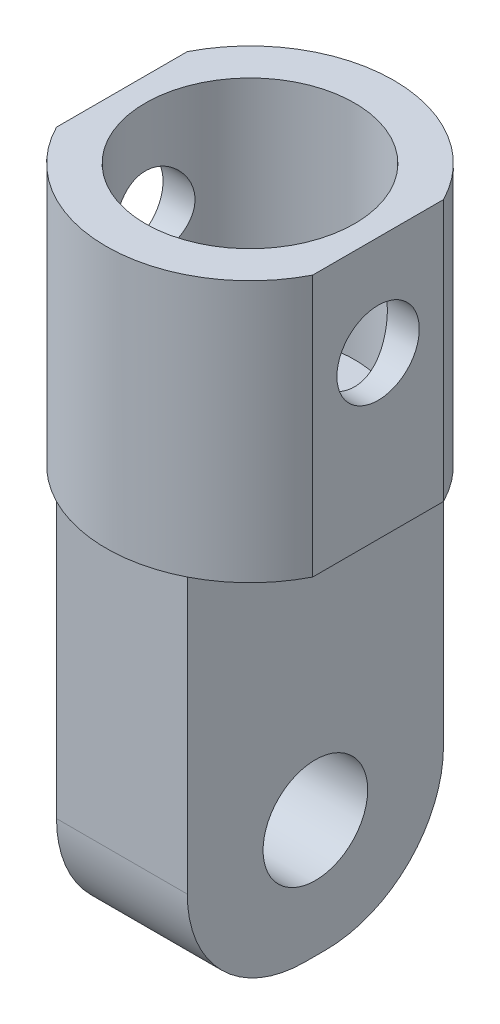
ISO-10303-21;
HEADER;
FILE_DESCRIPTION(('STEP AP214'),'2;1');
FILE_NAME('part.step','',(''),(''),'','','');
FILE_SCHEMA(('AUTOMOTIVE_DESIGN { 1 0 10303 214 1 1 1 1 }'));
ENDSEC;
DATA;
#1=APPLICATION_CONTEXT('core data for automotive mechanical design processes');
#2=APPLICATION_PROTOCOL_DEFINITION('international standard','automotive_design',2000,#1);
#3=PRODUCT_CONTEXT('',#1,'mechanical');
#4=PRODUCT('Part','Part','',(#3));
#5=PRODUCT_RELATED_PRODUCT_CATEGORY('part','',(#4));
#6=PRODUCT_DEFINITION_FORMATION('','',#4);
#7=PRODUCT_DEFINITION_CONTEXT('part definition',#1,'design');
#8=PRODUCT_DEFINITION('design','',#6,#7);
#9=PRODUCT_DEFINITION_SHAPE('','',#8);
#10=(LENGTH_UNIT() NAMED_UNIT(*) SI_UNIT(.MILLI.,.METRE.));
#11=(NAMED_UNIT(*) PLANE_ANGLE_UNIT() SI_UNIT($,.RADIAN.));
#12=(NAMED_UNIT(*) SI_UNIT($,.STERADIAN.) SOLID_ANGLE_UNIT());
#13=UNCERTAINTY_MEASURE_WITH_UNIT(LENGTH_MEASURE(1.E-05),#10,'distance_accuracy_value','');
#14=(GEOMETRIC_REPRESENTATION_CONTEXT(3) GLOBAL_UNCERTAINTY_ASSIGNED_CONTEXT((#13)) GLOBAL_UNIT_ASSIGNED_CONTEXT((#10,
#11,#12)) REPRESENTATION_CONTEXT('',''));
#15=CARTESIAN_POINT('',(0.,0.,0.));
#16=DIRECTION('',(0.,0.,1.));
#17=DIRECTION('',(1.,0.,0.));
#18=AXIS2_PLACEMENT_3D('',#15,#16,#17);
#19=CARTESIAN_POINT('',(0.,20.,0.));
#20=DIRECTION('',(0.,-1.,0.));
#21=DIRECTION('',(0.,0.,-1.));
#22=AXIS2_PLACEMENT_3D('',#19,#20,#21);
#23=CYLINDRICAL_SURFACE('',#22,11.);
#24=CARTESIAN_POINT('',(0.,20.,0.));
#25=DIRECTION('',(0.,1.,0.));
#26=DIRECTION('',(0.,0.,1.));
#27=AXIS2_PLACEMENT_3D('',#24,#25,#26);
#28=CIRCLE('',#27,11.);
#29=CARTESIAN_POINT('',(9.79795897113271,20.,-5.));
#30=VERTEX_POINT('',#29);
#31=CARTESIAN_POINT('',(-9.79795897113271,20.,-5.));
#32=VERTEX_POINT('',#31);
#33=EDGE_CURVE('E132',#30,#32,#28,.T.);
#34=ORIENTED_EDGE('',*,*,#33,.F.);
#35=DIRECTION('',(0.,1.,0.));
#36=VECTOR('',#35,1.);
#37=CARTESIAN_POINT('',(9.79795897113271,-30.,-5.));
#38=LINE('',#37,#36);
#39=CARTESIAN_POINT('',(9.79795897113271,0.,-5.));
#40=VERTEX_POINT('',#39);
#41=EDGE_CURVE('E49',#40,#30,#38,.T.);
#42=ORIENTED_EDGE('',*,*,#41,.F.);
#43=CARTESIAN_POINT('',(0.,0.,0.));
#44=DIRECTION('',(0.,1.,0.));
#45=DIRECTION('',(0.,0.,1.));
#46=AXIS2_PLACEMENT_3D('',#43,#44,#45);
#47=CIRCLE('',#46,11.);
#48=CARTESIAN_POINT('',(5.,0.,-9.79795897113272));
#49=VERTEX_POINT('',#48);
#50=EDGE_CURVE('E142',#40,#49,#47,.T.);
#51=ORIENTED_EDGE('',*,*,#50,.T.);
#52=CARTESIAN_POINT('',(-5.,0.,-9.79795897113271));
#53=VERTEX_POINT('',#52);
#54=EDGE_CURVE('E143',#49,#53,#47,.T.);
#55=ORIENTED_EDGE('',*,*,#54,.T.);
#56=CARTESIAN_POINT('',(-9.79795897113271,0.,-5.));
#57=VERTEX_POINT('',#56);
#58=EDGE_CURVE('E203',#53,#57,#47,.T.);
#59=ORIENTED_EDGE('',*,*,#58,.T.);
#60=DIRECTION('',(0.,1.,0.));
#61=VECTOR('',#60,1.);
#62=CARTESIAN_POINT('',(-9.79795897113271,-30.,-5.));
#63=LINE('',#62,#61);
#64=EDGE_CURVE('E447',#57,#32,#63,.T.);
#65=ORIENTED_EDGE('',*,*,#64,.T.);
#66=EDGE_LOOP('',(#34,#42,#51,#55,#59,#65));
#67=FACE_BOUND('',#66,.T.);
#68=ADVANCED_FACE('F34',(#67),#23,.T.);
#69=CARTESIAN_POINT('',(0.,0.,0.));
#70=DIRECTION('',(0.,1.,0.));
#71=DIRECTION('',(0.,0.,1.));
#72=AXIS2_PLACEMENT_3D('',#69,#70,#71);
#73=PLANE('',#72);
#74=ORIENTED_EDGE('',*,*,#50,.F.);
#75=DIRECTION('',(0.,0.,1.));
#76=VECTOR('',#75,1.);
#77=CARTESIAN_POINT('',(9.79795897113271,0.,0.));
#78=LINE('',#77,#76);
#79=CARTESIAN_POINT('',(9.79795897113271,0.,5.));
#80=VERTEX_POINT('',#79);
#81=EDGE_CURVE('E126',#40,#80,#78,.T.);
#82=ORIENTED_EDGE('',*,*,#81,.T.);
#83=CARTESIAN_POINT('',(5.,0.,9.79795897113272));
#84=VERTEX_POINT('',#83);
#85=EDGE_CURVE('E125',#84,#80,#47,.T.);
#86=ORIENTED_EDGE('',*,*,#85,.F.);
#87=DIRECTION('',(0.,0.,1.));
#88=VECTOR('',#87,1.);
#89=CARTESIAN_POINT('',(5.,0.,9.79795897113272));
#90=LINE('',#89,#88);
#91=EDGE_CURVE('E146',#49,#84,#90,.T.);
#92=ORIENTED_EDGE('',*,*,#91,.F.);
#93=EDGE_LOOP('',(#74,#82,#86,#92));
#94=FACE_BOUND('',#93,.T.);
#95=ADVANCED_FACE('F221',(#94),#73,.F.);
#96=DIRECTION('',(1.,0.,0.));
#97=VECTOR('',#96,1.);
#98=CARTESIAN_POINT('',(-5.,0.,-9.79795897113272));
#99=LINE('',#98,#97);
#100=EDGE_CURVE('E176',#53,#49,#99,.T.);
#101=ORIENTED_EDGE('',*,*,#100,.F.);
#102=ORIENTED_EDGE('',*,*,#54,.F.);
#103=EDGE_LOOP('',(#101,#102));
#104=FACE_BOUND('',#103,.T.);
#105=ADVANCED_FACE('F226',(#104),#73,.F.);
#106=CARTESIAN_POINT('',(-9.79795897113271,0.,5.));
#107=VERTEX_POINT('',#106);
#108=CARTESIAN_POINT('',(-5.,0.,9.79795897113272));
#109=VERTEX_POINT('',#108);
#110=EDGE_CURVE('E202',#107,#109,#47,.T.);
#111=ORIENTED_EDGE('',*,*,#110,.F.);
#112=DIRECTION('',(0.,0.,-1.));
#113=VECTOR('',#112,1.);
#114=CARTESIAN_POINT('',(-9.79795897113271,0.,0.));
#115=LINE('',#114,#113);
#116=EDGE_CURVE('E431',#107,#57,#115,.T.);
#117=ORIENTED_EDGE('',*,*,#116,.T.);
#118=ORIENTED_EDGE('',*,*,#58,.F.);
#119=DIRECTION('',(0.,0.,-1.));
#120=VECTOR('',#119,1.);
#121=CARTESIAN_POINT('',(-5.,0.,9.79795897113272));
#122=LINE('',#121,#120);
#123=EDGE_CURVE('E425',#109,#53,#122,.T.);
#124=ORIENTED_EDGE('',*,*,#123,.F.);
#125=EDGE_LOOP('',(#111,#117,#118,#124));
#126=FACE_BOUND('',#125,.T.);
#127=ADVANCED_FACE('F338',(#126),#73,.F.);
#128=DIRECTION('',(-1.,0.,0.));
#129=VECTOR('',#128,1.);
#130=CARTESIAN_POINT('',(-5.,0.,9.79795897113272));
#131=LINE('',#130,#129);
#132=EDGE_CURVE('E190',#84,#109,#131,.T.);
#133=ORIENTED_EDGE('',*,*,#132,.F.);
#134=EDGE_CURVE('E199',#109,#84,#47,.T.);
#135=ORIENTED_EDGE('',*,*,#134,.F.);
#136=EDGE_LOOP('',(#133,#135));
#137=FACE_BOUND('',#136,.T.);
#138=ADVANCED_FACE('F217',(#137),#73,.F.);
#139=ORIENTED_EDGE('',*,*,#85,.T.);
#140=DIRECTION('',(0.,1.,0.));
#141=VECTOR('',#140,1.);
#142=CARTESIAN_POINT('',(9.79795897113271,-30.,5.));
#143=LINE('',#142,#141);
#144=CARTESIAN_POINT('',(9.79795897113271,20.,5.));
#145=VERTEX_POINT('',#144);
#146=EDGE_CURVE('E111',#80,#145,#143,.T.);
#147=ORIENTED_EDGE('',*,*,#146,.T.);
#148=CARTESIAN_POINT('',(-9.79795897113271,20.,5.));
#149=VERTEX_POINT('',#148);
#150=EDGE_CURVE('E122',#149,#145,#28,.T.);
#151=ORIENTED_EDGE('',*,*,#150,.F.);
#152=DIRECTION('',(0.,1.,0.));
#153=VECTOR('',#152,1.);
#154=CARTESIAN_POINT('',(-9.79795897113271,-30.,5.));
#155=LINE('',#154,#153);
#156=EDGE_CURVE('E57',#107,#149,#155,.T.);
#157=ORIENTED_EDGE('',*,*,#156,.F.);
#158=ORIENTED_EDGE('',*,*,#110,.T.);
#159=ORIENTED_EDGE('',*,*,#134,.T.);
#160=EDGE_LOOP('',(#139,#147,#151,#157,#158,#159));
#161=FACE_BOUND('',#160,.T.);
#162=ADVANCED_FACE('F121',(#161),#23,.T.);
#163=CARTESIAN_POINT('',(0.,20.,0.));
#164=DIRECTION('',(0.,1.,0.));
#165=DIRECTION('',(0.,0.,1.));
#166=AXIS2_PLACEMENT_3D('',#163,#164,#165);
#167=PLANE('',#166);
#168=DIRECTION('',(0.,0.,1.));
#169=VECTOR('',#168,1.);
#170=CARTESIAN_POINT('',(9.79795897113271,20.,5.));
#171=LINE('',#170,#169);
#172=EDGE_CURVE('E108',#30,#145,#171,.T.);
#173=ORIENTED_EDGE('',*,*,#172,.F.);
#174=ORIENTED_EDGE('',*,*,#33,.T.);
#175=DIRECTION('',(0.,0.,-1.));
#176=VECTOR('',#175,1.);
#177=CARTESIAN_POINT('',(-9.79795897113271,20.,-5.));
#178=LINE('',#177,#176);
#179=EDGE_CURVE('E130',#149,#32,#178,.T.);
#180=ORIENTED_EDGE('',*,*,#179,.F.);
#181=ORIENTED_EDGE('',*,*,#150,.T.);
#182=EDGE_LOOP('',(#173,#174,#180,#181));
#183=FACE_BOUND('',#182,.T.);
#184=CARTESIAN_POINT('',(0.,20.,0.));
#185=DIRECTION('',(0.,1.,0.));
#186=DIRECTION('',(0.,0.,1.));
#187=AXIS2_PLACEMENT_3D('',#184,#185,#186);
#188=CIRCLE('',#187,8.);
#189=CARTESIAN_POINT('',(0.,20.,8.));
#190=VERTEX_POINT('',#189);
#191=EDGE_CURVE('E139',#190,#190,#188,.T.);
#192=ORIENTED_EDGE('',*,*,#191,.F.);
#193=EDGE_LOOP('',(#192));
#194=FACE_BOUND('',#193,.T.);
#195=ADVANCED_FACE('F128',(#183,#194),#167,.T.);
#196=CARTESIAN_POINT('',(0.,3.,0.));
#197=DIRECTION('',(0.,1.,0.));
#198=DIRECTION('',(0.,0.,1.));
#199=AXIS2_PLACEMENT_3D('',#196,#197,#198);
#200=CYLINDRICAL_SURFACE('',#199,8.);
#201=CARTESIAN_POINT('',(7.35374054478399,12.35,3.15));
#202=CARTESIAN_POINT('',(7.35374704275754,12.1810348254645,3.14999329602681));
#203=CARTESIAN_POINT('',(7.35964488132014,12.0117807408823,3.136323798316));
#204=CARTESIAN_POINT('',(7.38248098553594,11.6781322197495,3.08217479301927));
#205=CARTESIAN_POINT('',(7.39944798830626,11.5137515999202,3.04162549725112));
#206=CARTESIAN_POINT('',(7.44219035883316,11.1952112308682,2.93547843708839));
#207=CARTESIAN_POINT('',(7.46793314944103,11.0410161629554,2.86997320893021));
#208=CARTESIAN_POINT('',(7.52527807571537,10.7458441574431,2.71604659017176));
#209=CARTESIAN_POINT('',(7.5568787965306,10.604864040423,2.62763073107179));
#210=CARTESIAN_POINT('',(7.6243406753394,10.3322290586944,2.42515070634289));
#211=CARTESIAN_POINT('',(7.66033608931628,10.2013979668871,2.31002154319964));
#212=CARTESIAN_POINT('',(7.7314206563645,9.96030105864672,2.05962652874696));
#213=CARTESIAN_POINT('',(7.76650949423601,9.85004231410292,1.92435378156596));
#214=CARTESIAN_POINT('',(7.83343105566126,9.64917322972754,1.63118886560851));
#215=CARTESIAN_POINT('',(7.86508928300074,9.5594691952287,1.47263229358019));
#216=CARTESIAN_POINT('',(7.91996137827719,9.40835631734754,1.14121079140085));
#217=CARTESIAN_POINT('',(7.94317858100774,9.34693629724391,0.968351545009344));
#218=CARTESIAN_POINT('',(7.97760300100542,9.25705763120076,0.62186368052048));
#219=CARTESIAN_POINT('',(7.98932412078716,9.22718348561409,0.448654316915275));
#220=CARTESIAN_POINT('',(8.00128981699939,9.19669238432047,0.0993109398634188));
#221=CARTESIAN_POINT('',(8.00153853623343,9.19606486734988,-0.0768219948664005));
#222=CARTESIAN_POINT('',(7.99084778436078,9.22329638075693,-0.416802700095247));
#223=CARTESIAN_POINT('',(7.98051685822801,9.2496059616175,-0.580797145639845));
#224=CARTESIAN_POINT('',(7.95064223197148,9.32733679922551,-0.901825546505655));
#225=CARTESIAN_POINT('',(7.93109785766046,9.37875989364565,-1.05885899154069));
#226=CARTESIAN_POINT('',(7.8843454024343,9.50589437907237,-1.36431257562693));
#227=CARTESIAN_POINT('',(7.85702699397564,9.58195778332258,-1.51256861644556));
#228=CARTESIAN_POINT('',(7.79745124224497,9.75588883950001,-1.79459197448035));
#229=CARTESIAN_POINT('',(7.76519223059879,9.85376386201245,-1.92835437123989));
#230=CARTESIAN_POINT('',(7.69659093911767,10.0758294529874,-2.1866584602033));
#231=CARTESIAN_POINT('',(7.66011945703273,10.2013013105333,-2.310065969567));
#232=CARTESIAN_POINT('',(7.58880712754323,10.4713221286176,-2.53454320387747));
#233=CARTESIAN_POINT('',(7.553966783344,10.6158769243813,-2.63560607084148));
#234=CARTESIAN_POINT('',(7.48899894486205,10.9248777482246,-2.81500765606465));
#235=CARTESIAN_POINT('',(7.45902170730814,11.0897510536562,-2.89266936284605));
#236=CARTESIAN_POINT('',(7.40892855951886,11.4317298928055,-3.01868029615616));
#237=CARTESIAN_POINT('',(7.38880648155347,11.6088276965787,-3.06704786055927));
#238=CARTESIAN_POINT('',(7.36218798104948,11.9589384447005,-3.13038432114018));
#239=CARTESIAN_POINT('',(7.35495056696353,12.1315651914776,-3.14717290224851));
#240=CARTESIAN_POINT('',(7.35281298095376,12.477283285111,-3.1521676514501));
#241=CARTESIAN_POINT('',(7.35790924586713,12.6503744833574,-3.14038207452997));
#242=CARTESIAN_POINT('',(7.37910628602425,12.9822049983873,-3.09021824857935));
#243=CARTESIAN_POINT('',(7.39459262006625,13.1412125408824,-3.05332324089283));
#244=CARTESIAN_POINT('',(7.4340711795128,13.4506833507078,-2.95589716956288));
#245=CARTESIAN_POINT('',(7.45806525425653,13.6011447520953,-2.89536096671034));
#246=CARTESIAN_POINT('',(7.51302654114041,13.8959294549088,-2.74967381330338));
#247=CARTESIAN_POINT('',(7.54423339679519,14.0397696928278,-2.66363861750228));
#248=CARTESIAN_POINT('',(7.60972923637411,14.3116113493187,-2.47030884050269));
#249=CARTESIAN_POINT('',(7.64401944148352,14.4396064441698,-2.36300581556816));
#250=CARTESIAN_POINT('',(7.71476506492439,14.6855861340799,-2.12116738694325));
#251=CARTESIAN_POINT('',(7.75120094196753,14.80221044507,-1.9852375661815));
#252=CARTESIAN_POINT('',(7.81982622775979,15.0111922499939,-1.69485929096313));
#253=CARTESIAN_POINT('',(7.85201550832089,15.1035490114693,-1.5404102777535));
#254=CARTESIAN_POINT('',(7.90858796312407,15.2609564175179,-1.2170121289435));
#255=CARTESIAN_POINT('',(7.9329800723445,15.3260383438282,-1.04807987375407));
#256=CARTESIAN_POINT('',(7.97118812121244,15.4264459305688,-0.700472141627424));
#257=CARTESIAN_POINT('',(7.98500960197808,15.4617871820221,-0.521801822073315));
#258=CARTESIAN_POINT('',(7.99994379441823,15.4999009359343,-0.172023093807263));
#259=CARTESIAN_POINT('',(8.00180774710103,15.5045989616119,-0.00115489996758918));
#260=CARTESIAN_POINT('',(7.99462825322163,15.4863441084831,0.33884601897924));
#261=CARTESIAN_POINT('',(7.98558637023366,15.4633951934308,0.507978989360327));
#262=CARTESIAN_POINT('',(7.95797910382892,15.3918693895303,0.834682917542958));
#263=CARTESIAN_POINT('',(7.93969799094074,15.3440563126753,0.992447017028855));
#264=CARTESIAN_POINT('',(7.89555520360269,15.2249507353376,1.2976962702007));
#265=CARTESIAN_POINT('',(7.86969211068241,15.1536538410895,1.44517949409847));
#266=CARTESIAN_POINT('',(7.81152999458652,14.9860830383519,1.73276226452653));
#267=CARTESIAN_POINT('',(7.77899899444042,14.8888532626213,1.87225692732363));
#268=CARTESIAN_POINT('',(7.71143975396398,14.6736247689673,2.13352731641731));
#269=CARTESIAN_POINT('',(7.67641052967724,14.5556178405284,2.25529600305304));
#270=CARTESIAN_POINT('',(7.60521894307104,14.2938701588752,2.48515233855983));
#271=CARTESIAN_POINT('',(7.56911338498987,14.1490151951204,2.59199289134014));
#272=CARTESIAN_POINT('',(7.50213424885552,13.8422619442103,2.7799243440735));
#273=CARTESIAN_POINT('',(7.47126135480711,13.6803614333681,2.86101187884541));
#274=CARTESIAN_POINT('',(7.42103948750944,13.3586204748034,2.98872423836275));
#275=CARTESIAN_POINT('',(7.40091540410349,13.1998528672849,3.03775412092433));
#276=CARTESIAN_POINT('',(7.37077165320347,12.8759157945658,3.11019360507334));
#277=CARTESIAN_POINT('',(7.36072355076697,12.7107657186273,3.13367532094609));
#278=CARTESIAN_POINT('',(7.35546253541203,12.5124737052819,3.14597623774214));
#279=CARTESIAN_POINT('',(7.35481789442196,12.4800042777911,3.14748394931112));
#280=CARTESIAN_POINT('',(7.35395626004343,12.415026802197,3.14949650784939));
#281=CARTESIAN_POINT('',(7.35373929419499,12.3825187517416,3.15000129023534));
#282=CARTESIAN_POINT('',(7.35374054478399,12.35,3.15));
#283=B_SPLINE_CURVE_WITH_KNOTS('',3,(#201,#202,#203,#204,#205,#206,#207,#208,#209,#210,#211,
#212,#213,#214,#215,#216,#217,#218,#219,#220,#221,#222,#223,#224,#225,#226,#227,#228,#229,#230,
#231,#232,#233,#234,#235,#236,#237,#238,#239,#240,#241,#242,#243,#244,#245,#246,#247,#248,#249,
#250,#251,#252,#253,#254,#255,#256,#257,#258,#259,#260,#261,#262,#263,#264,#265,#266,#267,#268,
#269,#270,#271,#272,#273,#274,#275,#276,#277,#278,#279,#280,#281,#282),.UNSPECIFIED.,.T.,.F.,(4,
2,2,2,2,2,2,2,2,2,2,2,2,2,2,2,2,2,2,2,2,2,2,2,2,2,2,2,2,2,2,2,2,2,2,2,2,2,2,2,4),(0.,
0.50676126546723,1.0148434185748,1.52105966329531,2.02715380179734,2.55866183405412,
3.09035224067078,3.64225546279532,4.19394040710254,4.71965573384978,5.24518121781984,
5.74208781746511,6.23903078352885,6.74341170580973,7.24796332771068,7.78473278251434,
8.32166675377088,8.87290305844942,9.42379393645169,9.94183310433109,10.4597226301176,
10.9494069694217,11.439197817398,11.9484939719859,12.4579927334078,13.0037438581491,
13.5495114532015,14.0946513783633,14.6395053452137,15.1497627845319,15.6599470767221,
16.1553114101332,16.6507684777057,17.1678909411488,17.6852182166148,18.2333628641277,
18.7815791089893,19.2815446889011,19.7800953353359,19.8776194716298,19.9751498877601),.UNSPECIFIED.);
#284=CARTESIAN_POINT('',(7.35374054478399,12.35,3.15));
#285=VERTEX_POINT('',#284);
#286=EDGE_CURVE('E116',#285,#285,#283,.T.);
#287=ORIENTED_EDGE('',*,*,#286,.T.);
#288=EDGE_LOOP('',(#287));
#289=FACE_BOUND('',#288,.T.);
#290=CARTESIAN_POINT('',(-7.35374054478399,12.35,3.15));
#291=CARTESIAN_POINT('',(-7.35374704275754,12.5189651745355,3.14999329602681));
#292=CARTESIAN_POINT('',(-7.35964488132014,12.6882192591177,3.136323798316));
#293=CARTESIAN_POINT('',(-7.38248098553594,13.0218677802505,3.08217479301927));
#294=CARTESIAN_POINT('',(-7.39944798830626,13.1862484000798,3.04162549725112));
#295=CARTESIAN_POINT('',(-7.44219035883316,13.5047887691318,2.93547843708839));
#296=CARTESIAN_POINT('',(-7.46793314944103,13.6589838370446,2.86997320893021));
#297=CARTESIAN_POINT('',(-7.52527807571537,13.9541558425569,2.71604659017176));
#298=CARTESIAN_POINT('',(-7.5568787965306,14.095135959577,2.62763073107179));
#299=CARTESIAN_POINT('',(-7.6243406753394,14.3677709413056,2.42515070634289));
#300=CARTESIAN_POINT('',(-7.66033608931628,14.4986020331129,2.31002154319964));
#301=CARTESIAN_POINT('',(-7.7314206563645,14.7396989413533,2.05962652874696));
#302=CARTESIAN_POINT('',(-7.76650949423601,14.8499576858971,1.92435378156596));
#303=CARTESIAN_POINT('',(-7.83343105566126,15.0508267702725,1.63118886560851));
#304=CARTESIAN_POINT('',(-7.86508928300074,15.1405308047713,1.47263229358019));
#305=CARTESIAN_POINT('',(-7.91996137827719,15.2916436826525,1.14121079140085));
#306=CARTESIAN_POINT('',(-7.94317858100774,15.3530637027561,0.968351545009344));
#307=CARTESIAN_POINT('',(-7.97760300100542,15.4429423687992,0.62186368052048));
#308=CARTESIAN_POINT('',(-7.98932412078716,15.4728165143859,0.448654316915275));
#309=CARTESIAN_POINT('',(-8.00128981699939,15.5033076156795,0.0993109398634188));
#310=CARTESIAN_POINT('',(-8.00153853623343,15.5039351326501,-0.0768219948664005));
#311=CARTESIAN_POINT('',(-7.99084778436078,15.4767036192431,-0.416802700095247));
#312=CARTESIAN_POINT('',(-7.98051685822801,15.4503940383825,-0.580797145639845));
#313=CARTESIAN_POINT('',(-7.95064223197148,15.3726632007745,-0.901825546505655));
#314=CARTESIAN_POINT('',(-7.93109785766046,15.3212401063544,-1.05885899154069));
#315=CARTESIAN_POINT('',(-7.8843454024343,15.1941056209276,-1.36431257562693));
#316=CARTESIAN_POINT('',(-7.85702699397564,15.1180422166774,-1.51256861644556));
#317=CARTESIAN_POINT('',(-7.79745124224497,14.9441111605,-1.79459197448035));
#318=CARTESIAN_POINT('',(-7.76519223059879,14.8462361379876,-1.92835437123989));
#319=CARTESIAN_POINT('',(-7.69659093911767,14.6241705470126,-2.1866584602033));
#320=CARTESIAN_POINT('',(-7.66011945703273,14.4986986894667,-2.310065969567));
#321=CARTESIAN_POINT('',(-7.58880712754323,14.2286778713824,-2.53454320387747));
#322=CARTESIAN_POINT('',(-7.553966783344,14.0841230756187,-2.63560607084148));
#323=CARTESIAN_POINT('',(-7.48899894486205,13.7751222517754,-2.81500765606464));
#324=CARTESIAN_POINT('',(-7.45902170730814,13.6102489463438,-2.89266936284605));
#325=CARTESIAN_POINT('',(-7.40892855951886,13.2682701071945,-3.01868029615616));
#326=CARTESIAN_POINT('',(-7.38880648155347,13.0911723034213,-3.06704786055927));
#327=CARTESIAN_POINT('',(-7.36218798104948,12.7410615552995,-3.13038432114018));
#328=CARTESIAN_POINT('',(-7.35495056696353,12.5684348085224,-3.14717290224851));
#329=CARTESIAN_POINT('',(-7.35281298095376,12.222716714889,-3.1521676514501));
#330=CARTESIAN_POINT('',(-7.35790924586713,12.0496255166426,-3.14038207452997));
#331=CARTESIAN_POINT('',(-7.37910628602425,11.7177950016127,-3.09021824857935));
#332=CARTESIAN_POINT('',(-7.39459262006625,11.5587874591176,-3.05332324089283));
#333=CARTESIAN_POINT('',(-7.4340711795128,11.2493166492922,-2.95589716956288));
#334=CARTESIAN_POINT('',(-7.45806525425653,11.0988552479047,-2.89536096671034));
#335=CARTESIAN_POINT('',(-7.51302654114041,10.8040705450912,-2.74967381330338));
#336=CARTESIAN_POINT('',(-7.54423339679519,10.6602303071722,-2.66363861750228));
#337=CARTESIAN_POINT('',(-7.60972923637411,10.3883886506813,-2.47030884050269));
#338=CARTESIAN_POINT('',(-7.64401944148352,10.2603935558302,-2.36300581556816));
#339=CARTESIAN_POINT('',(-7.71476506492439,10.0144138659201,-2.12116738694325));
#340=CARTESIAN_POINT('',(-7.75120094196753,9.89778955493003,-1.9852375661815));
#341=CARTESIAN_POINT('',(-7.81982622775979,9.68880775000611,-1.69485929096313));
#342=CARTESIAN_POINT('',(-7.85201550832089,9.59645098853067,-1.5404102777535));
#343=CARTESIAN_POINT('',(-7.90858796312407,9.4390435824821,-1.2170121289435));
#344=CARTESIAN_POINT('',(-7.9329800723445,9.37396165617179,-1.04807987375407));
#345=CARTESIAN_POINT('',(-7.97118812121244,9.27355406943117,-0.700472141627424));
#346=CARTESIAN_POINT('',(-7.98500960197808,9.23821281797785,-0.521801822073315));
#347=CARTESIAN_POINT('',(-7.99994379441823,9.20009906406566,-0.172023093807263));
#348=CARTESIAN_POINT('',(-8.00180774710103,9.19540103838806,-0.0011548999675891));
#349=CARTESIAN_POINT('',(-7.99462825322163,9.21365589151688,0.33884601897924));
#350=CARTESIAN_POINT('',(-7.98558637023366,9.23660480656925,0.507978989360327));
#351=CARTESIAN_POINT('',(-7.95797910382892,9.3081306104697,0.834682917542958));
#352=CARTESIAN_POINT('',(-7.93969799094074,9.35594368732471,0.992447017028855));
#353=CARTESIAN_POINT('',(-7.89555520360269,9.47504926466245,1.2976962702007));
#354=CARTESIAN_POINT('',(-7.86969211068241,9.54634615891046,1.44517949409847));
#355=CARTESIAN_POINT('',(-7.81152999458652,9.7139169616481,1.73276226452653));
#356=CARTESIAN_POINT('',(-7.77899899444041,9.81114673737868,1.87225692732363));
#357=CARTESIAN_POINT('',(-7.71143975396398,10.0263752310327,2.13352731641731));
#358=CARTESIAN_POINT('',(-7.67641052967724,10.1443821594716,2.25529600305304));
#359=CARTESIAN_POINT('',(-7.60521894307104,10.4061298411248,2.48515233855983));
#360=CARTESIAN_POINT('',(-7.56911338498987,10.5509848048796,2.59199289134014));
#361=CARTESIAN_POINT('',(-7.50213424885552,10.8577380557897,2.7799243440735));
#362=CARTESIAN_POINT('',(-7.47126135480711,11.0196385666319,2.86101187884541));
#363=CARTESIAN_POINT('',(-7.42103948750944,11.3413795251966,2.98872423836275));
#364=CARTESIAN_POINT('',(-7.40091540410349,11.5001471327151,3.03775412092433));
#365=CARTESIAN_POINT('',(-7.37077165320347,11.8240842054342,3.11019360507334));
#366=CARTESIAN_POINT('',(-7.36072355076697,11.9892342813727,3.13367532094609));
#367=CARTESIAN_POINT('',(-7.35546253541203,12.1875262947181,3.14597623774214));
#368=CARTESIAN_POINT('',(-7.35481789442196,12.2199957222089,3.14748394931112));
#369=CARTESIAN_POINT('',(-7.35395626004343,12.284973197803,3.14949650784939));
#370=CARTESIAN_POINT('',(-7.35373929419499,12.3174812482584,3.15000129023534));
#371=CARTESIAN_POINT('',(-7.35374054478399,12.35,3.15));
#372=B_SPLINE_CURVE_WITH_KNOTS('',3,(#290,#291,#292,#293,#294,#295,#296,#297,#298,#299,#300,
#301,#302,#303,#304,#305,#306,#307,#308,#309,#310,#311,#312,#313,#314,#315,#316,#317,#318,#319,
#320,#321,#322,#323,#324,#325,#326,#327,#328,#329,#330,#331,#332,#333,#334,#335,#336,#337,#338,
#339,#340,#341,#342,#343,#344,#345,#346,#347,#348,#349,#350,#351,#352,#353,#354,#355,#356,#357,
#358,#359,#360,#361,#362,#363,#364,#365,#366,#367,#368,#369,#370,#371),.UNSPECIFIED.,.T.,.F.,(4,
2,2,2,2,2,2,2,2,2,2,2,2,2,2,2,2,2,2,2,2,2,2,2,2,2,2,2,2,2,2,2,2,2,2,2,2,2,2,2,4),(0.,
0.506761265467228,1.0148434185748,1.52105966329531,2.02715380179734,2.55866183405412,
3.09035224067078,3.64225546279532,4.19394040710254,4.71965573384978,5.24518121781984,
5.74208781746511,6.23903078352885,6.74341170580973,7.24796332771068,7.78473278251434,
8.32166675377088,8.87290305844942,9.42379393645169,9.94183310433109,10.4597226301176,
10.9494069694218,11.439197817398,11.9484939719859,12.4579927334078,13.0037438581491,
13.5495114532015,14.0946513783633,14.6395053452137,15.1497627845319,15.6599470767221,
16.1553114101332,16.6507684777057,17.1678909411488,17.6852182166148,18.2333628641277,
18.7815791089893,19.2815446889011,19.7800953353359,19.8776194716298,19.9751498877601),.UNSPECIFIED.);
#373=CARTESIAN_POINT('',(-7.35374054478399,12.35,3.15));
#374=VERTEX_POINT('',#373);
#375=EDGE_CURVE('E263',#374,#374,#372,.T.);
#376=ORIENTED_EDGE('',*,*,#375,.T.);
#377=EDGE_LOOP('',(#376));
#378=FACE_BOUND('',#377,.T.);
#379=CARTESIAN_POINT('',(0.,3.,0.));
#380=DIRECTION('',(0.,1.,0.));
#381=DIRECTION('',(0.,0.,1.));
#382=AXIS2_PLACEMENT_3D('',#379,#380,#381);
#383=CIRCLE('',#382,8.);
#384=CARTESIAN_POINT('',(0.,3.,8.));
#385=VERTEX_POINT('',#384);
#386=EDGE_CURVE('E197',#385,#385,#383,.T.);
#387=ORIENTED_EDGE('',*,*,#386,.F.);
#388=EDGE_LOOP('',(#387));
#389=FACE_BOUND('',#388,.T.);
#390=ORIENTED_EDGE('',*,*,#191,.T.);
#391=EDGE_LOOP('',(#390));
#392=FACE_BOUND('',#391,.T.);
#393=ADVANCED_FACE('F207',(#289,#378,#389,#392),#200,.F.);
#394=CARTESIAN_POINT('',(0.,3.,0.));
#395=DIRECTION('',(0.,1.,0.));
#396=DIRECTION('',(0.,0.,1.));
#397=AXIS2_PLACEMENT_3D('',#394,#395,#396);
#398=PLANE('',#397);
#399=ORIENTED_EDGE('',*,*,#386,.T.);
#400=EDGE_LOOP('',(#399));
#401=FACE_BOUND('',#400,.T.);
#402=ADVANCED_FACE('F214',(#401),#398,.T.);
#403=CARTESIAN_POINT('',(5.,-30.,9.79795897113272));
#404=DIRECTION('',(-1.,0.,0.));
#405=DIRECTION('',(0.,0.,1.));
#406=AXIS2_PLACEMENT_3D('',#403,#404,#405);
#407=PLANE('',#406);
#408=CARTESIAN_POINT('',(5.,-21.,0.));
#409=DIRECTION('',(1.,0.,0.));
#410=DIRECTION('',(0.,0.,-1.));
#411=AXIS2_PLACEMENT_3D('',#408,#409,#410);
#412=CIRCLE('',#411,4.);
#413=CARTESIAN_POINT('',(5.,-21.,-4.));
#414=VERTEX_POINT('',#413);
#415=EDGE_CURVE('E147',#414,#414,#412,.T.);
#416=ORIENTED_EDGE('',*,*,#415,.F.);
#417=EDGE_LOOP('',(#416));
#418=FACE_BOUND('',#417,.T.);
#419=DIRECTION('',(0.,1.,0.));
#420=VECTOR('',#419,1.);
#421=CARTESIAN_POINT('',(5.,-30.,9.79795897113272));
#422=LINE('',#421,#420);
#423=CARTESIAN_POINT('',(5.,-21.,9.79795897113272));
#424=VERTEX_POINT('',#423);
#425=EDGE_CURVE('E166',#424,#84,#422,.T.);
#426=ORIENTED_EDGE('',*,*,#425,.F.);
#427=CARTESIAN_POINT('',(5.,-21.,0.797958971132716));
#428=DIRECTION('',(-1.,0.,0.));
#429=DIRECTION('',(0.,0.,1.));
#430=AXIS2_PLACEMENT_3D('',#427,#428,#429);
#431=CIRCLE('',#430,9.);
#432=CARTESIAN_POINT('',(5.,-30.,0.797958971132716));
#433=VERTEX_POINT('',#432);
#434=EDGE_CURVE('E42',#424,#433,#431,.F.);
#435=ORIENTED_EDGE('',*,*,#434,.T.);
#436=DIRECTION('',(0.,0.,1.));
#437=VECTOR('',#436,1.);
#438=CARTESIAN_POINT('',(5.,-30.,9.79795897113272));
#439=LINE('',#438,#437);
#440=CARTESIAN_POINT('',(5.,-30.,-0.797958971132716));
#441=VERTEX_POINT('',#440);
#442=EDGE_CURVE('E164',#441,#433,#439,.T.);
#443=ORIENTED_EDGE('',*,*,#442,.F.);
#444=CARTESIAN_POINT('',(5.,-21.,-0.797958971132716));
#445=DIRECTION('',(-1.,0.,0.));
#446=DIRECTION('',(0.,0.,1.));
#447=AXIS2_PLACEMENT_3D('',#444,#445,#446);
#448=CIRCLE('',#447,9.);
#449=CARTESIAN_POINT('',(5.,-21.,-9.79795897113272));
#450=VERTEX_POINT('',#449);
#451=EDGE_CURVE('E157',#441,#450,#448,.F.);
#452=ORIENTED_EDGE('',*,*,#451,.T.);
#453=DIRECTION('',(0.,1.,0.));
#454=VECTOR('',#453,1.);
#455=CARTESIAN_POINT('',(5.,-30.,-9.79795897113272));
#456=LINE('',#455,#454);
#457=EDGE_CURVE('E194',#450,#49,#456,.T.);
#458=ORIENTED_EDGE('',*,*,#457,.T.);
#459=ORIENTED_EDGE('',*,*,#91,.T.);
#460=EDGE_LOOP('',(#426,#435,#443,#452,#458,#459));
#461=FACE_BOUND('',#460,.T.);
#462=ADVANCED_FACE('F163',(#418,#461),#407,.F.);
#463=CARTESIAN_POINT('',(-5.,-30.,9.79795897113272));
#464=DIRECTION('',(0.,0.,-1.));
#465=DIRECTION('',(-1.,0.,0.));
#466=AXIS2_PLACEMENT_3D('',#463,#464,#465);
#467=PLANE('',#466);
#468=DIRECTION('',(0.,1.,0.));
#469=VECTOR('',#468,1.);
#470=CARTESIAN_POINT('',(-5.,-30.,9.79795897113272));
#471=LINE('',#470,#469);
#472=CARTESIAN_POINT('',(-5.,-21.,9.79795897113272));
#473=VERTEX_POINT('',#472);
#474=EDGE_CURVE('E184',#473,#109,#471,.T.);
#475=ORIENTED_EDGE('',*,*,#474,.F.);
#476=DIRECTION('',(-1.,0.,0.));
#477=VECTOR('',#476,1.);
#478=CARTESIAN_POINT('',(5.,-21.,9.79795897113272));
#479=LINE('',#478,#477);
#480=EDGE_CURVE('E155',#473,#424,#479,.F.);
#481=ORIENTED_EDGE('',*,*,#480,.T.);
#482=ORIENTED_EDGE('',*,*,#425,.T.);
#483=ORIENTED_EDGE('',*,*,#132,.T.);
#484=EDGE_LOOP('',(#475,#481,#482,#483));
#485=FACE_BOUND('',#484,.T.);
#486=ADVANCED_FACE('F188',(#485),#467,.F.);
#487=CARTESIAN_POINT('',(-5.,-30.,9.79795897113272));
#488=DIRECTION('',(1.,0.,0.));
#489=DIRECTION('',(0.,0.,-1.));
#490=AXIS2_PLACEMENT_3D('',#487,#488,#489);
#491=PLANE('',#490);
#492=CARTESIAN_POINT('',(-5.,-21.,0.));
#493=DIRECTION('',(1.,0.,0.));
#494=DIRECTION('',(0.,0.,-1.));
#495=AXIS2_PLACEMENT_3D('',#492,#493,#494);
#496=CIRCLE('',#495,4.);
#497=CARTESIAN_POINT('',(-5.,-21.,-4.));
#498=VERTEX_POINT('',#497);
#499=EDGE_CURVE('E144',#498,#498,#496,.T.);
#500=ORIENTED_EDGE('',*,*,#499,.T.);
#501=EDGE_LOOP('',(#500));
#502=FACE_BOUND('',#501,.T.);
#503=DIRECTION('',(0.,0.,-1.));
#504=VECTOR('',#503,1.);
#505=CARTESIAN_POINT('',(-5.,-30.,9.79795897113272));
#506=LINE('',#505,#504);
#507=CARTESIAN_POINT('',(-5.,-30.,0.797958971132716));
#508=VERTEX_POINT('',#507);
#509=CARTESIAN_POINT('',(-5.,-30.,-0.797958971132716));
#510=VERTEX_POINT('',#509);
#511=EDGE_CURVE('E175',#508,#510,#506,.T.);
#512=ORIENTED_EDGE('',*,*,#511,.F.);
#513=CARTESIAN_POINT('',(-5.,-21.,0.797958971132716));
#514=DIRECTION('',(1.,0.,0.));
#515=DIRECTION('',(0.,0.,-1.));
#516=AXIS2_PLACEMENT_3D('',#513,#514,#515);
#517=CIRCLE('',#516,9.);
#518=EDGE_CURVE('E153',#508,#473,#517,.F.);
#519=ORIENTED_EDGE('',*,*,#518,.T.);
#520=ORIENTED_EDGE('',*,*,#474,.T.);
#521=ORIENTED_EDGE('',*,*,#123,.T.);
#522=DIRECTION('',(0.,1.,0.));
#523=VECTOR('',#522,1.);
#524=CARTESIAN_POINT('',(-5.,-30.,-9.79795897113272));
#525=LINE('',#524,#523);
#526=CARTESIAN_POINT('',(-5.,-21.,-9.79795897113272));
#527=VERTEX_POINT('',#526);
#528=EDGE_CURVE('E191',#527,#53,#525,.T.);
#529=ORIENTED_EDGE('',*,*,#528,.F.);
#530=CARTESIAN_POINT('',(-5.,-21.,-0.797958971132716));
#531=DIRECTION('',(1.,0.,0.));
#532=DIRECTION('',(0.,0.,-1.));
#533=AXIS2_PLACEMENT_3D('',#530,#531,#532);
#534=CIRCLE('',#533,9.);
#535=EDGE_CURVE('E151',#527,#510,#534,.F.);
#536=ORIENTED_EDGE('',*,*,#535,.T.);
#537=EDGE_LOOP('',(#512,#519,#520,#521,#529,#536));
#538=FACE_BOUND('',#537,.T.);
#539=ADVANCED_FACE('F182',(#502,#538),#491,.F.);
#540=CARTESIAN_POINT('',(-5.,-30.,-9.79795897113272));
#541=DIRECTION('',(0.,0.,1.));
#542=DIRECTION('',(1.,0.,0.));
#543=AXIS2_PLACEMENT_3D('',#540,#541,#542);
#544=PLANE('',#543);
#545=ORIENTED_EDGE('',*,*,#457,.F.);
#546=DIRECTION('',(1.,0.,0.));
#547=VECTOR('',#546,1.);
#548=CARTESIAN_POINT('',(-5.,-21.,-9.79795897113272));
#549=LINE('',#548,#547);
#550=EDGE_CURVE('E11',#450,#527,#549,.F.);
#551=ORIENTED_EDGE('',*,*,#550,.T.);
#552=ORIENTED_EDGE('',*,*,#528,.T.);
#553=ORIENTED_EDGE('',*,*,#100,.T.);
#554=EDGE_LOOP('',(#545,#551,#552,#553));
#555=FACE_BOUND('',#554,.T.);
#556=ADVANCED_FACE('F241',(#555),#544,.F.);
#557=CARTESIAN_POINT('',(0.,-30.,0.));
#558=DIRECTION('',(0.,-1.,0.));
#559=DIRECTION('',(0.,0.,-1.));
#560=AXIS2_PLACEMENT_3D('',#557,#558,#559);
#561=PLANE('',#560);
#562=ORIENTED_EDGE('',*,*,#442,.T.);
#563=DIRECTION('',(-1.,0.,0.));
#564=VECTOR('',#563,1.);
#565=CARTESIAN_POINT('',(-5.,-30.,0.797958971132716));
#566=LINE('',#565,#564);
#567=EDGE_CURVE('E135',#433,#508,#566,.T.);
#568=ORIENTED_EDGE('',*,*,#567,.T.);
#569=ORIENTED_EDGE('',*,*,#511,.T.);
#570=DIRECTION('',(1.,0.,0.));
#571=VECTOR('',#570,1.);
#572=CARTESIAN_POINT('',(5.,-30.,-0.797958971132716));
#573=LINE('',#572,#571);
#574=EDGE_CURVE('E131',#510,#441,#573,.T.);
#575=ORIENTED_EDGE('',*,*,#574,.T.);
#576=EDGE_LOOP('',(#562,#568,#569,#575));
#577=FACE_BOUND('',#576,.T.);
#578=ADVANCED_FACE('F171',(#577),#561,.T.);
#579=CARTESIAN_POINT('',(-11.,-21.,0.));
#580=DIRECTION('',(1.,0.,0.));
#581=DIRECTION('',(0.,0.,-1.));
#582=AXIS2_PLACEMENT_3D('',#579,#580,#581);
#583=CYLINDRICAL_SURFACE('',#582,4.);
#584=ORIENTED_EDGE('',*,*,#415,.T.);
#585=EDGE_LOOP('',(#584));
#586=FACE_BOUND('',#585,.T.);
#587=ORIENTED_EDGE('',*,*,#499,.F.);
#588=EDGE_LOOP('',(#587));
#589=FACE_BOUND('',#588,.T.);
#590=ADVANCED_FACE('F229',(#586,#589),#583,.F.);
#591=CARTESIAN_POINT('',(0.,-21.,0.797958971132716));
#592=DIRECTION('',(1.,0.,0.));
#593=DIRECTION('',(0.,0.,-1.));
#594=AXIS2_PLACEMENT_3D('',#591,#592,#593);
#595=CYLINDRICAL_SURFACE('',#594,9.);
#596=ORIENTED_EDGE('',*,*,#434,.F.);
#597=ORIENTED_EDGE('',*,*,#480,.F.);
#598=ORIENTED_EDGE('',*,*,#518,.F.);
#599=ORIENTED_EDGE('',*,*,#567,.F.);
#600=EDGE_LOOP('',(#596,#597,#598,#599));
#601=FACE_BOUND('',#600,.T.);
#602=ADVANCED_FACE('F178',(#601),#595,.T.);
#603=CARTESIAN_POINT('',(0.,-21.,-0.797958971132716));
#604=DIRECTION('',(-1.,0.,0.));
#605=DIRECTION('',(0.,0.,1.));
#606=AXIS2_PLACEMENT_3D('',#603,#604,#605);
#607=CYLINDRICAL_SURFACE('',#606,9.);
#608=ORIENTED_EDGE('',*,*,#535,.F.);
#609=ORIENTED_EDGE('',*,*,#550,.F.);
#610=ORIENTED_EDGE('',*,*,#451,.F.);
#611=ORIENTED_EDGE('',*,*,#574,.F.);
#612=EDGE_LOOP('',(#608,#609,#610,#611));
#613=FACE_BOUND('',#612,.T.);
#614=ADVANCED_FACE('F36',(#613),#607,.T.);
#615=CARTESIAN_POINT('',(-9.79795897113271,-30.,-5.));
#616=DIRECTION('',(1.,0.,0.));
#617=DIRECTION('',(0.,0.,-1.));
#618=AXIS2_PLACEMENT_3D('',#615,#616,#617);
#619=PLANE('',#618);
#620=CARTESIAN_POINT('',(-9.79795897113271,12.35,0.));
#621=DIRECTION('',(-1.,0.,0.));
#622=DIRECTION('',(0.,0.,1.));
#623=AXIS2_PLACEMENT_3D('',#620,#621,#622);
#624=CIRCLE('',#623,3.15);
#625=CARTESIAN_POINT('',(-9.79795897113271,12.35,3.15));
#626=VERTEX_POINT('',#625);
#627=EDGE_CURVE('E287',#626,#626,#624,.T.);
#628=ORIENTED_EDGE('',*,*,#627,.F.);
#629=EDGE_LOOP('',(#628));
#630=FACE_BOUND('',#629,.T.);
#631=ORIENTED_EDGE('',*,*,#156,.T.);
#632=ORIENTED_EDGE('',*,*,#179,.T.);
#633=ORIENTED_EDGE('',*,*,#64,.F.);
#634=ORIENTED_EDGE('',*,*,#116,.F.);
#635=EDGE_LOOP('',(#631,#632,#633,#634));
#636=FACE_BOUND('',#635,.T.);
#637=ADVANCED_FACE('F234',(#630,#636),#619,.F.);
#638=CARTESIAN_POINT('',(9.79795897113271,-30.,5.));
#639=DIRECTION('',(-1.,0.,0.));
#640=DIRECTION('',(0.,0.,1.));
#641=AXIS2_PLACEMENT_3D('',#638,#639,#640);
#642=PLANE('',#641);
#643=CARTESIAN_POINT('',(9.79795897113271,12.35,0.));
#644=DIRECTION('',(-1.,0.,0.));
#645=DIRECTION('',(0.,0.,1.));
#646=AXIS2_PLACEMENT_3D('',#643,#644,#645);
#647=CIRCLE('',#646,3.15);
#648=CARTESIAN_POINT('',(9.79795897113271,12.35,3.15));
#649=VERTEX_POINT('',#648);
#650=EDGE_CURVE('E286',#649,#649,#647,.T.);
#651=ORIENTED_EDGE('',*,*,#650,.T.);
#652=EDGE_LOOP('',(#651));
#653=FACE_BOUND('',#652,.T.);
#654=ORIENTED_EDGE('',*,*,#41,.T.);
#655=ORIENTED_EDGE('',*,*,#172,.T.);
#656=ORIENTED_EDGE('',*,*,#146,.F.);
#657=ORIENTED_EDGE('',*,*,#81,.F.);
#658=EDGE_LOOP('',(#654,#655,#656,#657));
#659=FACE_BOUND('',#658,.T.);
#660=ADVANCED_FACE('F110',(#653,#659),#642,.F.);
#661=CARTESIAN_POINT('',(9.79795897113271,12.35,0.));
#662=DIRECTION('',(-1.,0.,0.));
#663=DIRECTION('',(0.,0.,1.));
#664=AXIS2_PLACEMENT_3D('',#661,#662,#663);
#665=CYLINDRICAL_SURFACE('',#664,3.15);
#666=ORIENTED_EDGE('',*,*,#650,.F.);
#667=EDGE_LOOP('',(#666));
#668=FACE_BOUND('',#667,.T.);
#669=ORIENTED_EDGE('',*,*,#286,.F.);
#670=EDGE_LOOP('',(#669));
#671=FACE_BOUND('',#670,.T.);
#672=ADVANCED_FACE('F272',(#668,#671),#665,.F.);
#673=ORIENTED_EDGE('',*,*,#627,.T.);
#674=EDGE_LOOP('',(#673));
#675=FACE_BOUND('',#674,.T.);
#676=ORIENTED_EDGE('',*,*,#375,.F.);
#677=EDGE_LOOP('',(#676));
#678=FACE_BOUND('',#677,.T.);
#679=ADVANCED_FACE('F275',(#675,#678),#665,.F.);
#680=CLOSED_SHELL('',(#68,#95,#105,#127,#138,#162,#195,#393,#402,#462,#486,#539,#556,#578,#590,
#602,#614,#637,#660,#672,#679));
#681=MANIFOLD_SOLID_BREP('B2',#680);
#682=ADVANCED_BREP_SHAPE_REPRESENTATION('',(#18,#681),#14);
#683=SHAPE_DEFINITION_REPRESENTATION(#9,#682);
ENDSEC;
END-ISO-10303-21;
